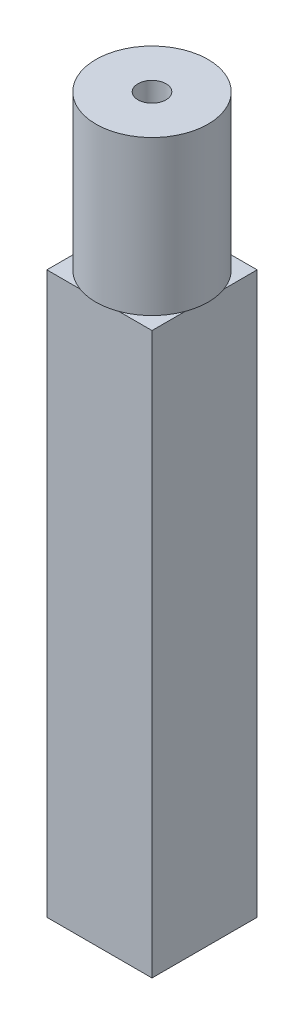
ISO-10303-21;
HEADER;
FILE_DESCRIPTION(('STEP AP214'),'2;1');
FILE_NAME('part.step','',(''),(''),'','','');
FILE_SCHEMA(('AUTOMOTIVE_DESIGN { 1 0 10303 214 1 1 1 1 }'));
ENDSEC;
DATA;
#1=APPLICATION_CONTEXT('core data for automotive mechanical design processes');
#2=APPLICATION_PROTOCOL_DEFINITION('international standard','automotive_design',2000,#1);
#3=PRODUCT_CONTEXT('',#1,'mechanical');
#4=PRODUCT('Part','Part','',(#3));
#5=PRODUCT_RELATED_PRODUCT_CATEGORY('part','',(#4));
#6=PRODUCT_DEFINITION_FORMATION('','',#4);
#7=PRODUCT_DEFINITION_CONTEXT('part definition',#1,'design');
#8=PRODUCT_DEFINITION('design','',#6,#7);
#9=PRODUCT_DEFINITION_SHAPE('','',#8);
#10=(LENGTH_UNIT() NAMED_UNIT(*) SI_UNIT(.MILLI.,.METRE.));
#11=(NAMED_UNIT(*) PLANE_ANGLE_UNIT() SI_UNIT($,.RADIAN.));
#12=(NAMED_UNIT(*) SI_UNIT($,.STERADIAN.) SOLID_ANGLE_UNIT());
#13=UNCERTAINTY_MEASURE_WITH_UNIT(LENGTH_MEASURE(1.E-05),#10,'distance_accuracy_value','');
#14=(GEOMETRIC_REPRESENTATION_CONTEXT(3) GLOBAL_UNCERTAINTY_ASSIGNED_CONTEXT((#13)) GLOBAL_UNIT_ASSIGNED_CONTEXT((#10,
#11,#12)) REPRESENTATION_CONTEXT('',''));
#15=CARTESIAN_POINT('',(0.,0.,0.));
#16=DIRECTION('',(0.,0.,1.));
#17=DIRECTION('',(1.,0.,0.));
#18=AXIS2_PLACEMENT_3D('',#15,#16,#17);
#19=CARTESIAN_POINT('',(0.,0.,0.));
#20=DIRECTION('',(0.,1.,0.));
#21=DIRECTION('',(0.,0.,1.));
#22=AXIS2_PLACEMENT_3D('',#19,#20,#21);
#23=PLANE('',#22);
#24=DIRECTION('',(0.,0.,-1.));
#25=VECTOR('',#24,1.);
#26=CARTESIAN_POINT('',(-7.5,0.,7.5));
#27=LINE('',#26,#25);
#28=CARTESIAN_POINT('',(-7.5,0.,2.783882181415));
#29=VERTEX_POINT('',#28);
#30=CARTESIAN_POINT('',(-7.5,0.,-2.783882181415));
#31=VERTEX_POINT('',#30);
#32=EDGE_CURVE('E11',#29,#31,#27,.T.);
#33=ORIENTED_EDGE('',*,*,#32,.F.);
#34=CARTESIAN_POINT('',(0.,0.,0.));
#35=DIRECTION('',(0.,1.,0.));
#36=DIRECTION('',(0.,0.,1.));
#37=AXIS2_PLACEMENT_3D('',#34,#35,#36);
#38=CIRCLE('',#37,8.);
#39=EDGE_CURVE('E157',#31,#29,#38,.T.);
#40=ORIENTED_EDGE('',*,*,#39,.F.);
#41=EDGE_LOOP('',(#33,#40));
#42=FACE_BOUND('',#41,.T.);
#43=ADVANCED_FACE('F35',(#42),#23,.F.);
#44=DIRECTION('',(-1.,0.,0.));
#45=VECTOR('',#44,1.);
#46=CARTESIAN_POINT('',(-7.5,0.,7.5));
#47=LINE('',#46,#45);
#48=CARTESIAN_POINT('',(2.78388218141501,0.,7.5));
#49=VERTEX_POINT('',#48);
#50=CARTESIAN_POINT('',(-2.78388218141501,0.,7.5));
#51=VERTEX_POINT('',#50);
#52=EDGE_CURVE('E44',#49,#51,#47,.T.);
#53=ORIENTED_EDGE('',*,*,#52,.F.);
#54=EDGE_CURVE('E53',#51,#49,#38,.T.);
#55=ORIENTED_EDGE('',*,*,#54,.F.);
#56=EDGE_LOOP('',(#53,#55));
#57=FACE_BOUND('',#56,.T.);
#58=ADVANCED_FACE('F188',(#57),#23,.F.);
#59=DIRECTION('',(0.,0.,1.));
#60=VECTOR('',#59,1.);
#61=CARTESIAN_POINT('',(7.5,0.,7.5));
#62=LINE('',#61,#60);
#63=CARTESIAN_POINT('',(7.5,0.,-2.78388218141501));
#64=VERTEX_POINT('',#63);
#65=CARTESIAN_POINT('',(7.5,0.,2.78388218141501));
#66=VERTEX_POINT('',#65);
#67=EDGE_CURVE('E139',#64,#66,#62,.T.);
#68=ORIENTED_EDGE('',*,*,#67,.F.);
#69=EDGE_CURVE('E144',#66,#64,#38,.T.);
#70=ORIENTED_EDGE('',*,*,#69,.F.);
#71=EDGE_LOOP('',(#68,#70));
#72=FACE_BOUND('',#71,.T.);
#73=ADVANCED_FACE('F185',(#72),#23,.F.);
#74=DIRECTION('',(1.,0.,0.));
#75=VECTOR('',#74,1.);
#76=CARTESIAN_POINT('',(-7.5,0.,-7.5));
#77=LINE('',#76,#75);
#78=CARTESIAN_POINT('',(-2.78388218141501,0.,-7.5));
#79=VERTEX_POINT('',#78);
#80=CARTESIAN_POINT('',(2.78388218141501,0.,-7.5));
#81=VERTEX_POINT('',#80);
#82=EDGE_CURVE('E135',#79,#81,#77,.T.);
#83=ORIENTED_EDGE('',*,*,#82,.F.);
#84=EDGE_CURVE('E151',#81,#79,#38,.T.);
#85=ORIENTED_EDGE('',*,*,#84,.F.);
#86=EDGE_LOOP('',(#83,#85));
#87=FACE_BOUND('',#86,.T.);
#88=ADVANCED_FACE('F187',(#87),#23,.F.);
#89=CARTESIAN_POINT('',(0.,22.,0.));
#90=DIRECTION('',(0.,-1.,0.));
#91=DIRECTION('',(0.,0.,-1.));
#92=AXIS2_PLACEMENT_3D('',#89,#90,#91);
#93=CYLINDRICAL_SURFACE('',#92,8.);
#94=CARTESIAN_POINT('',(0.,22.,0.));
#95=DIRECTION('',(0.,1.,0.));
#96=DIRECTION('',(0.,0.,1.));
#97=AXIS2_PLACEMENT_3D('',#94,#95,#96);
#98=CIRCLE('',#97,8.);
#99=CARTESIAN_POINT('',(0.,22.,8.));
#100=VERTEX_POINT('',#99);
#101=EDGE_CURVE('E133',#100,#100,#98,.T.);
#102=ORIENTED_EDGE('',*,*,#101,.F.);
#103=EDGE_LOOP('',(#102));
#104=FACE_BOUND('',#103,.T.);
#105=EDGE_CURVE('E39',#49,#66,#38,.T.);
#106=ORIENTED_EDGE('',*,*,#105,.T.);
#107=ORIENTED_EDGE('',*,*,#69,.T.);
#108=EDGE_CURVE('E149',#64,#81,#38,.T.);
#109=ORIENTED_EDGE('',*,*,#108,.T.);
#110=ORIENTED_EDGE('',*,*,#84,.T.);
#111=EDGE_CURVE('E154',#79,#31,#38,.T.);
#112=ORIENTED_EDGE('',*,*,#111,.T.);
#113=ORIENTED_EDGE('',*,*,#39,.T.);
#114=EDGE_CURVE('E129',#29,#51,#38,.T.);
#115=ORIENTED_EDGE('',*,*,#114,.T.);
#116=ORIENTED_EDGE('',*,*,#54,.T.);
#117=EDGE_LOOP('',(#106,#107,#109,#110,#112,#113,#115,#116));
#118=FACE_BOUND('',#117,.T.);
#119=ADVANCED_FACE('F37',(#104,#118),#93,.T.);
#120=CARTESIAN_POINT('',(0.,22.,0.));
#121=DIRECTION('',(0.,1.,0.));
#122=DIRECTION('',(0.,0.,1.));
#123=AXIS2_PLACEMENT_3D('',#120,#121,#122);
#124=PLANE('',#123);
#125=CARTESIAN_POINT('',(0.,22.,0.));
#126=DIRECTION('',(0.,1.,0.));
#127=DIRECTION('',(0.,0.,1.));
#128=AXIS2_PLACEMENT_3D('',#125,#126,#127);
#129=CIRCLE('',#128,2.);
#130=CARTESIAN_POINT('',(0.,22.,2.));
#131=VERTEX_POINT('',#130);
#132=EDGE_CURVE('E329',#131,#131,#129,.T.);
#133=ORIENTED_EDGE('',*,*,#132,.F.);
#134=EDGE_LOOP('',(#133));
#135=FACE_BOUND('',#134,.T.);
#136=ORIENTED_EDGE('',*,*,#101,.T.);
#137=EDGE_LOOP('',(#136));
#138=FACE_BOUND('',#137,.T.);
#139=ADVANCED_FACE('F222',(#135,#138),#124,.T.);
#140=CARTESIAN_POINT('',(0.,0.,0.));
#141=DIRECTION('',(0.,-1.,0.));
#142=DIRECTION('',(0.,0.,-1.));
#143=AXIS2_PLACEMENT_3D('',#140,#141,#142);
#144=PLANE('',#143);
#145=ORIENTED_EDGE('',*,*,#105,.F.);
#146=CARTESIAN_POINT('',(7.5,0.,7.5));
#147=VERTEX_POINT('',#146);
#148=EDGE_CURVE('E122',#147,#49,#47,.T.);
#149=ORIENTED_EDGE('',*,*,#148,.F.);
#150=EDGE_CURVE('E174',#66,#147,#62,.T.);
#151=ORIENTED_EDGE('',*,*,#150,.F.);
#152=EDGE_LOOP('',(#145,#149,#151));
#153=FACE_BOUND('',#152,.T.);
#154=ADVANCED_FACE('F180',(#153),#144,.F.);
#155=ORIENTED_EDGE('',*,*,#108,.F.);
#156=CARTESIAN_POINT('',(7.5,0.,-7.5));
#157=VERTEX_POINT('',#156);
#158=EDGE_CURVE('E166',#157,#64,#62,.T.);
#159=ORIENTED_EDGE('',*,*,#158,.F.);
#160=EDGE_CURVE('E142',#81,#157,#77,.T.);
#161=ORIENTED_EDGE('',*,*,#160,.F.);
#162=EDGE_LOOP('',(#155,#159,#161));
#163=FACE_BOUND('',#162,.T.);
#164=ADVANCED_FACE('F232',(#163),#144,.F.);
#165=ORIENTED_EDGE('',*,*,#111,.F.);
#166=CARTESIAN_POINT('',(-7.5,0.,-7.5));
#167=VERTEX_POINT('',#166);
#168=EDGE_CURVE('E141',#167,#79,#77,.T.);
#169=ORIENTED_EDGE('',*,*,#168,.F.);
#170=EDGE_CURVE('E47',#31,#167,#27,.T.);
#171=ORIENTED_EDGE('',*,*,#170,.F.);
#172=EDGE_LOOP('',(#165,#169,#171));
#173=FACE_BOUND('',#172,.T.);
#174=ADVANCED_FACE('F241',(#173),#144,.F.);
#175=CARTESIAN_POINT('',(-7.5,-80.,7.5));
#176=DIRECTION('',(1.,0.,0.));
#177=DIRECTION('',(0.,0.,-1.));
#178=AXIS2_PLACEMENT_3D('',#175,#176,#177);
#179=PLANE('',#178);
#180=CARTESIAN_POINT('',(-7.5,0.,7.5));
#181=VERTEX_POINT('',#180);
#182=EDGE_CURVE('E46',#181,#29,#27,.T.);
#183=ORIENTED_EDGE('',*,*,#182,.T.);
#184=ORIENTED_EDGE('',*,*,#32,.T.);
#185=ORIENTED_EDGE('',*,*,#170,.T.);
#186=DIRECTION('',(0.,1.,0.));
#187=VECTOR('',#186,1.);
#188=CARTESIAN_POINT('',(-7.5,-80.,-7.5));
#189=LINE('',#188,#187);
#190=CARTESIAN_POINT('',(-7.5,-80.,-7.5));
#191=VERTEX_POINT('',#190);
#192=EDGE_CURVE('E107',#191,#167,#189,.T.);
#193=ORIENTED_EDGE('',*,*,#192,.F.);
#194=DIRECTION('',(0.,0.,-1.));
#195=VECTOR('',#194,1.);
#196=CARTESIAN_POINT('',(-7.5,-80.,7.5));
#197=LINE('',#196,#195);
#198=CARTESIAN_POINT('',(-7.5,-80.,7.5));
#199=VERTEX_POINT('',#198);
#200=EDGE_CURVE('E113',#199,#191,#197,.T.);
#201=ORIENTED_EDGE('',*,*,#200,.F.);
#202=DIRECTION('',(0.,1.,0.));
#203=VECTOR('',#202,1.);
#204=CARTESIAN_POINT('',(-7.5,-80.,7.5));
#205=LINE('',#204,#203);
#206=EDGE_CURVE('E176',#199,#181,#205,.T.);
#207=ORIENTED_EDGE('',*,*,#206,.T.);
#208=EDGE_LOOP('',(#183,#184,#185,#193,#201,#207));
#209=FACE_BOUND('',#208,.T.);
#210=ADVANCED_FACE('F125',(#209),#179,.F.);
#211=CARTESIAN_POINT('',(-7.5,-80.,-7.5));
#212=DIRECTION('',(0.,0.,1.));
#213=DIRECTION('',(1.,0.,0.));
#214=AXIS2_PLACEMENT_3D('',#211,#212,#213);
#215=PLANE('',#214);
#216=ORIENTED_EDGE('',*,*,#168,.T.);
#217=ORIENTED_EDGE('',*,*,#82,.T.);
#218=ORIENTED_EDGE('',*,*,#160,.T.);
#219=DIRECTION('',(0.,1.,0.));
#220=VECTOR('',#219,1.);
#221=CARTESIAN_POINT('',(7.5,-80.,-7.5));
#222=LINE('',#221,#220);
#223=CARTESIAN_POINT('',(7.5,-80.,-7.5));
#224=VERTEX_POINT('',#223);
#225=EDGE_CURVE('E109',#224,#157,#222,.T.);
#226=ORIENTED_EDGE('',*,*,#225,.F.);
#227=DIRECTION('',(1.,0.,0.));
#228=VECTOR('',#227,1.);
#229=CARTESIAN_POINT('',(-7.5,-80.,-7.5));
#230=LINE('',#229,#228);
#231=EDGE_CURVE('E102',#191,#224,#230,.T.);
#232=ORIENTED_EDGE('',*,*,#231,.F.);
#233=ORIENTED_EDGE('',*,*,#192,.T.);
#234=EDGE_LOOP('',(#216,#217,#218,#226,#232,#233));
#235=FACE_BOUND('',#234,.T.);
#236=ADVANCED_FACE('F105',(#235),#215,.F.);
#237=CARTESIAN_POINT('',(7.5,-80.,7.5));
#238=DIRECTION('',(-1.,0.,0.));
#239=DIRECTION('',(0.,0.,1.));
#240=AXIS2_PLACEMENT_3D('',#237,#238,#239);
#241=PLANE('',#240);
#242=ORIENTED_EDGE('',*,*,#158,.T.);
#243=ORIENTED_EDGE('',*,*,#67,.T.);
#244=ORIENTED_EDGE('',*,*,#150,.T.);
#245=DIRECTION('',(0.,1.,0.));
#246=VECTOR('',#245,1.);
#247=CARTESIAN_POINT('',(7.5,-80.,7.5));
#248=LINE('',#247,#246);
#249=CARTESIAN_POINT('',(7.5,-80.,7.5));
#250=VERTEX_POINT('',#249);
#251=EDGE_CURVE('E130',#250,#147,#248,.T.);
#252=ORIENTED_EDGE('',*,*,#251,.F.);
#253=DIRECTION('',(0.,0.,1.));
#254=VECTOR('',#253,1.);
#255=CARTESIAN_POINT('',(7.5,-80.,7.5));
#256=LINE('',#255,#254);
#257=EDGE_CURVE('E112',#224,#250,#256,.T.);
#258=ORIENTED_EDGE('',*,*,#257,.F.);
#259=ORIENTED_EDGE('',*,*,#225,.T.);
#260=EDGE_LOOP('',(#242,#243,#244,#252,#258,#259));
#261=FACE_BOUND('',#260,.T.);
#262=ADVANCED_FACE('F182',(#261),#241,.F.);
#263=CARTESIAN_POINT('',(-7.5,-80.,7.5));
#264=DIRECTION('',(0.,0.,-1.));
#265=DIRECTION('',(-1.,0.,0.));
#266=AXIS2_PLACEMENT_3D('',#263,#264,#265);
#267=PLANE('',#266);
#268=ORIENTED_EDGE('',*,*,#148,.T.);
#269=ORIENTED_EDGE('',*,*,#52,.T.);
#270=EDGE_CURVE('E162',#51,#181,#47,.T.);
#271=ORIENTED_EDGE('',*,*,#270,.T.);
#272=ORIENTED_EDGE('',*,*,#206,.F.);
#273=DIRECTION('',(-1.,0.,0.));
#274=VECTOR('',#273,1.);
#275=CARTESIAN_POINT('',(-7.5,-80.,7.5));
#276=LINE('',#275,#274);
#277=EDGE_CURVE('E118',#250,#199,#276,.T.);
#278=ORIENTED_EDGE('',*,*,#277,.F.);
#279=ORIENTED_EDGE('',*,*,#251,.T.);
#280=EDGE_LOOP('',(#268,#269,#271,#272,#278,#279));
#281=FACE_BOUND('',#280,.T.);
#282=ADVANCED_FACE('F169',(#281),#267,.F.);
#283=CARTESIAN_POINT('',(0.,-80.,0.));
#284=DIRECTION('',(0.,-1.,0.));
#285=DIRECTION('',(0.,0.,-1.));
#286=AXIS2_PLACEMENT_3D('',#283,#284,#285);
#287=PLANE('',#286);
#288=ORIENTED_EDGE('',*,*,#200,.T.);
#289=ORIENTED_EDGE('',*,*,#231,.T.);
#290=ORIENTED_EDGE('',*,*,#257,.T.);
#291=ORIENTED_EDGE('',*,*,#277,.T.);
#292=EDGE_LOOP('',(#288,#289,#290,#291));
#293=FACE_BOUND('',#292,.T.);
#294=ADVANCED_FACE('F116',(#293),#287,.T.);
#295=ORIENTED_EDGE('',*,*,#114,.F.);
#296=ORIENTED_EDGE('',*,*,#182,.F.);
#297=ORIENTED_EDGE('',*,*,#270,.F.);
#298=EDGE_LOOP('',(#295,#296,#297));
#299=FACE_BOUND('',#298,.T.);
#300=ADVANCED_FACE('F164',(#299),#144,.F.);
#301=CARTESIAN_POINT('',(0.,11.,0.));
#302=DIRECTION('',(0.,1.,0.));
#303=DIRECTION('',(0.,0.,1.));
#304=AXIS2_PLACEMENT_3D('',#301,#302,#303);
#305=CYLINDRICAL_SURFACE('',#304,2.);
#306=CARTESIAN_POINT('',(0.,11.,0.));
#307=DIRECTION('',(0.,1.,0.));
#308=DIRECTION('',(0.,0.,1.));
#309=AXIS2_PLACEMENT_3D('',#306,#307,#308);
#310=CIRCLE('',#309,2.);
#311=CARTESIAN_POINT('',(0.,11.,2.));
#312=VERTEX_POINT('',#311);
#313=EDGE_CURVE('E328',#312,#312,#310,.T.);
#314=ORIENTED_EDGE('',*,*,#313,.F.);
#315=EDGE_LOOP('',(#314));
#316=FACE_BOUND('',#315,.T.);
#317=ORIENTED_EDGE('',*,*,#132,.T.);
#318=EDGE_LOOP('',(#317));
#319=FACE_BOUND('',#318,.T.);
#320=ADVANCED_FACE('F298',(#316,#319),#305,.F.);
#321=CARTESIAN_POINT('',(0.,11.,0.));
#322=DIRECTION('',(0.,1.,0.));
#323=DIRECTION('',(0.,0.,1.));
#324=AXIS2_PLACEMENT_3D('',#321,#322,#323);
#325=PLANE('',#324);
#326=ORIENTED_EDGE('',*,*,#313,.T.);
#327=EDGE_LOOP('',(#326));
#328=FACE_BOUND('',#327,.T.);
#329=ADVANCED_FACE('F312',(#328),#325,.T.);
#330=CLOSED_SHELL('',(#43,#58,#73,#88,#119,#139,#154,#164,#174,#210,#236,#262,#282,#294,#300,
#320,#329));
#331=MANIFOLD_SOLID_BREP('B2',#330);
#332=ADVANCED_BREP_SHAPE_REPRESENTATION('',(#18,#331),#14);
#333=SHAPE_DEFINITION_REPRESENTATION(#9,#332);
ENDSEC;
END-ISO-10303-21;
